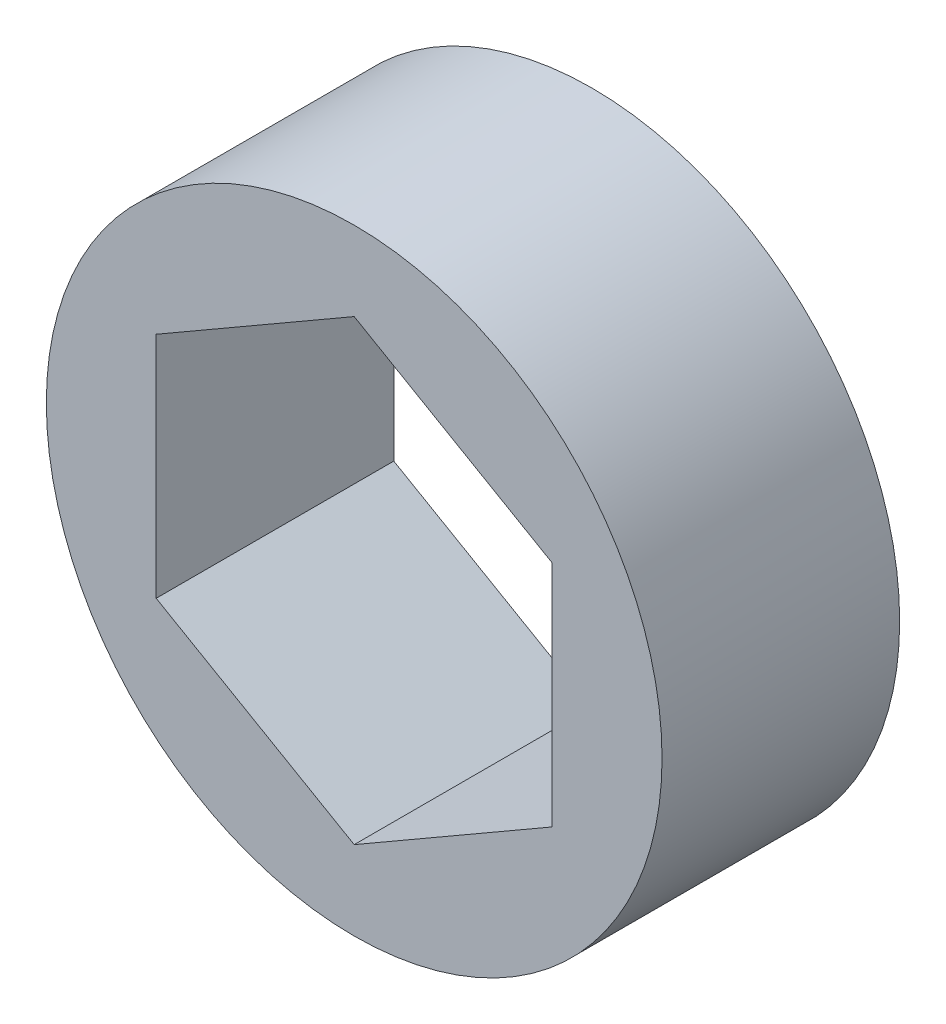
ISO-10303-21;
HEADER;
FILE_DESCRIPTION(('STEP AP214'),'2;1');
FILE_NAME('part.step','',(''),(''),'','','');
FILE_SCHEMA(('AUTOMOTIVE_DESIGN { 1 0 10303 214 1 1 1 1 }'));
ENDSEC;
DATA;
#1=APPLICATION_CONTEXT('core data for automotive mechanical design processes');
#2=APPLICATION_PROTOCOL_DEFINITION('international standard','automotive_design',2000,#1);
#3=PRODUCT_CONTEXT('',#1,'mechanical');
#4=PRODUCT('Part','Part','',(#3));
#5=PRODUCT_RELATED_PRODUCT_CATEGORY('part','',(#4));
#6=PRODUCT_DEFINITION_FORMATION('','',#4);
#7=PRODUCT_DEFINITION_CONTEXT('part definition',#1,'design');
#8=PRODUCT_DEFINITION('design','',#6,#7);
#9=PRODUCT_DEFINITION_SHAPE('','',#8);
#10=(LENGTH_UNIT() NAMED_UNIT(*) SI_UNIT(.MILLI.,.METRE.));
#11=(NAMED_UNIT(*) PLANE_ANGLE_UNIT() SI_UNIT($,.RADIAN.));
#12=(NAMED_UNIT(*) SI_UNIT($,.STERADIAN.) SOLID_ANGLE_UNIT());
#13=UNCERTAINTY_MEASURE_WITH_UNIT(LENGTH_MEASURE(1.E-05),#10,'distance_accuracy_value','');
#14=(GEOMETRIC_REPRESENTATION_CONTEXT(3) GLOBAL_UNCERTAINTY_ASSIGNED_CONTEXT((#13)) GLOBAL_UNIT_ASSIGNED_CONTEXT((#10,
#11,#12)) REPRESENTATION_CONTEXT('',''));
#15=CARTESIAN_POINT('',(0.,0.,0.));
#16=DIRECTION('',(0.,0.,1.));
#17=DIRECTION('',(1.,0.,0.));
#18=AXIS2_PLACEMENT_3D('',#15,#16,#17);
#19=CARTESIAN_POINT('',(-113.75212267549,2.16506350946108,3.));
#20=DIRECTION('',(-0.5,-0.866025403784438,0.));
#21=DIRECTION('',(0.866025403784438,-0.5,0.));
#22=AXIS2_PLACEMENT_3D('',#19,#20,#21);
#23=PLANE('',#22);
#24=DIRECTION('',(-0.866025403784438,0.5,0.));
#25=VECTOR('',#24,1.);
#26=CARTESIAN_POINT('',(-113.75212267549,2.16506350946108,0.));
#27=LINE('',#26,#25);
#28=CARTESIAN_POINT('',(-112.50212267549,1.44337567297406,0.));
#29=VERTEX_POINT('',#28);
#30=CARTESIAN_POINT('',(-115.00212267549,2.88675134594814,0.));
#31=VERTEX_POINT('',#30);
#32=EDGE_CURVE('E11',#29,#31,#27,.T.);
#33=ORIENTED_EDGE('',*,*,#32,.F.);
#34=DIRECTION('',(0.,0.,-1.));
#35=VECTOR('',#34,1.);
#36=CARTESIAN_POINT('',(-112.50212267549,1.44337567297406,3.));
#37=LINE('',#36,#35);
#38=CARTESIAN_POINT('',(-112.50212267549,1.44337567297406,3.));
#39=VERTEX_POINT('',#38);
#40=EDGE_CURVE('E23',#39,#29,#37,.T.);
#41=ORIENTED_EDGE('',*,*,#40,.F.);
#42=DIRECTION('',(-0.866025403784438,0.5,0.));
#43=VECTOR('',#42,1.);
#44=CARTESIAN_POINT('',(-113.75212267549,2.16506350946108,3.));
#45=LINE('',#44,#43);
#46=CARTESIAN_POINT('',(-115.00212267549,2.88675134594814,3.));
#47=VERTEX_POINT('',#46);
#48=EDGE_CURVE('E119',#39,#47,#45,.T.);
#49=ORIENTED_EDGE('',*,*,#48,.T.);
#50=DIRECTION('',(0.,0.,-1.));
#51=VECTOR('',#50,1.);
#52=CARTESIAN_POINT('',(-115.00212267549,2.88675134594814,3.));
#53=LINE('',#52,#51);
#54=EDGE_CURVE('E80',#47,#31,#53,.T.);
#55=ORIENTED_EDGE('',*,*,#54,.T.);
#56=EDGE_LOOP('',(#33,#41,#49,#55));
#57=FACE_BOUND('',#56,.T.);
#58=ADVANCED_FACE('F16',(#57),#23,.T.);
#59=CARTESIAN_POINT('',(-112.50212267549,0.,3.));
#60=DIRECTION('',(-1.,0.,0.));
#61=DIRECTION('',(0.,0.,1.));
#62=AXIS2_PLACEMENT_3D('',#59,#60,#61);
#63=PLANE('',#62);
#64=DIRECTION('',(0.,1.,0.));
#65=VECTOR('',#64,1.);
#66=CARTESIAN_POINT('',(-112.50212267549,0.,0.));
#67=LINE('',#66,#65);
#68=CARTESIAN_POINT('',(-112.50212267549,-1.44337567297405,0.));
#69=VERTEX_POINT('',#68);
#70=EDGE_CURVE('E115',#69,#29,#67,.T.);
#71=ORIENTED_EDGE('',*,*,#70,.F.);
#72=DIRECTION('',(0.,0.,-1.));
#73=VECTOR('',#72,1.);
#74=CARTESIAN_POINT('',(-112.50212267549,-1.44337567297405,3.));
#75=LINE('',#74,#73);
#76=CARTESIAN_POINT('',(-112.50212267549,-1.44337567297405,3.));
#77=VERTEX_POINT('',#76);
#78=EDGE_CURVE('E112',#77,#69,#75,.T.);
#79=ORIENTED_EDGE('',*,*,#78,.F.);
#80=DIRECTION('',(0.,1.,0.));
#81=VECTOR('',#80,1.);
#82=CARTESIAN_POINT('',(-112.50212267549,0.,3.));
#83=LINE('',#82,#81);
#84=EDGE_CURVE('E110',#77,#39,#83,.T.);
#85=ORIENTED_EDGE('',*,*,#84,.T.);
#86=ORIENTED_EDGE('',*,*,#40,.T.);
#87=EDGE_LOOP('',(#71,#79,#85,#86));
#88=FACE_BOUND('',#87,.T.);
#89=ADVANCED_FACE('F121',(#88),#63,.T.);
#90=CARTESIAN_POINT('',(-113.75212267549,-2.16506350946109,3.));
#91=DIRECTION('',(-0.5,0.866025403784439,0.));
#92=DIRECTION('',(-0.866025403784439,-0.5,0.));
#93=AXIS2_PLACEMENT_3D('',#90,#91,#92);
#94=PLANE('',#93);
#95=DIRECTION('',(0.866025403784439,0.5,0.));
#96=VECTOR('',#95,1.);
#97=CARTESIAN_POINT('',(-113.75212267549,-2.16506350946109,0.));
#98=LINE('',#97,#96);
#99=CARTESIAN_POINT('',(-115.00212267549,-2.88675134594815,0.));
#100=VERTEX_POINT('',#99);
#101=EDGE_CURVE('E107',#100,#69,#98,.T.);
#102=ORIENTED_EDGE('',*,*,#101,.F.);
#103=DIRECTION('',(0.,0.,-1.));
#104=VECTOR('',#103,1.);
#105=CARTESIAN_POINT('',(-115.00212267549,-2.88675134594815,3.));
#106=LINE('',#105,#104);
#107=CARTESIAN_POINT('',(-115.00212267549,-2.88675134594815,3.));
#108=VERTEX_POINT('',#107);
#109=EDGE_CURVE('E104',#108,#100,#106,.T.);
#110=ORIENTED_EDGE('',*,*,#109,.F.);
#111=DIRECTION('',(0.866025403784439,0.5,0.));
#112=VECTOR('',#111,1.);
#113=CARTESIAN_POINT('',(-113.75212267549,-2.16506350946109,3.));
#114=LINE('',#113,#112);
#115=EDGE_CURVE('E101',#108,#77,#114,.T.);
#116=ORIENTED_EDGE('',*,*,#115,.T.);
#117=ORIENTED_EDGE('',*,*,#78,.T.);
#118=EDGE_LOOP('',(#102,#110,#116,#117));
#119=FACE_BOUND('',#118,.T.);
#120=ADVANCED_FACE('F127',(#119),#94,.T.);
#121=CARTESIAN_POINT('',(-116.25212267549,-2.16506350946112,3.));
#122=DIRECTION('',(0.5,0.866025403784438,0.));
#123=DIRECTION('',(-0.866025403784438,0.5,0.));
#124=AXIS2_PLACEMENT_3D('',#121,#122,#123);
#125=PLANE('',#124);
#126=DIRECTION('',(0.866025403784438,-0.5,0.));
#127=VECTOR('',#126,1.);
#128=CARTESIAN_POINT('',(-116.25212267549,-2.16506350946112,0.));
#129=LINE('',#128,#127);
#130=CARTESIAN_POINT('',(-117.50212267549,-1.44337567297409,0.));
#131=VERTEX_POINT('',#130);
#132=EDGE_CURVE('E98',#131,#100,#129,.T.);
#133=ORIENTED_EDGE('',*,*,#132,.F.);
#134=DIRECTION('',(0.,0.,-1.));
#135=VECTOR('',#134,1.);
#136=CARTESIAN_POINT('',(-117.50212267549,-1.44337567297409,3.));
#137=LINE('',#136,#135);
#138=CARTESIAN_POINT('',(-117.50212267549,-1.44337567297409,3.));
#139=VERTEX_POINT('',#138);
#140=EDGE_CURVE('E96',#139,#131,#137,.T.);
#141=ORIENTED_EDGE('',*,*,#140,.F.);
#142=DIRECTION('',(0.866025403784438,-0.5,0.));
#143=VECTOR('',#142,1.);
#144=CARTESIAN_POINT('',(-116.25212267549,-2.16506350946112,3.));
#145=LINE('',#144,#143);
#146=EDGE_CURVE('E90',#139,#108,#145,.T.);
#147=ORIENTED_EDGE('',*,*,#146,.T.);
#148=ORIENTED_EDGE('',*,*,#109,.T.);
#149=EDGE_LOOP('',(#133,#141,#147,#148));
#150=FACE_BOUND('',#149,.T.);
#151=ADVANCED_FACE('F129',(#150),#125,.T.);
#152=CARTESIAN_POINT('',(-117.50212267549,0.,3.));
#153=DIRECTION('',(1.,0.,0.));
#154=DIRECTION('',(0.,0.,-1.));
#155=AXIS2_PLACEMENT_3D('',#152,#153,#154);
#156=PLANE('',#155);
#157=DIRECTION('',(0.,-1.,0.));
#158=VECTOR('',#157,1.);
#159=CARTESIAN_POINT('',(-117.50212267549,0.,0.));
#160=LINE('',#159,#158);
#161=CARTESIAN_POINT('',(-117.50212267549,1.44337567297407,0.));
#162=VERTEX_POINT('',#161);
#163=EDGE_CURVE('E71',#162,#131,#160,.T.);
#164=ORIENTED_EDGE('',*,*,#163,.F.);
#165=DIRECTION('',(0.,0.,-1.));
#166=VECTOR('',#165,1.);
#167=CARTESIAN_POINT('',(-117.50212267549,1.44337567297407,3.));
#168=LINE('',#167,#166);
#169=CARTESIAN_POINT('',(-117.50212267549,1.44337567297407,3.));
#170=VERTEX_POINT('',#169);
#171=EDGE_CURVE('E63',#170,#162,#168,.T.);
#172=ORIENTED_EDGE('',*,*,#171,.F.);
#173=DIRECTION('',(0.,-1.,0.));
#174=VECTOR('',#173,1.);
#175=CARTESIAN_POINT('',(-117.50212267549,0.,3.));
#176=LINE('',#175,#174);
#177=EDGE_CURVE('E68',#170,#139,#176,.T.);
#178=ORIENTED_EDGE('',*,*,#177,.T.);
#179=ORIENTED_EDGE('',*,*,#140,.T.);
#180=EDGE_LOOP('',(#164,#172,#178,#179));
#181=FACE_BOUND('',#180,.T.);
#182=ADVANCED_FACE('F65',(#181),#156,.T.);
#183=CARTESIAN_POINT('',(-116.25212267549,2.1650635094611,3.));
#184=DIRECTION('',(0.5,-0.866025403784439,0.));
#185=DIRECTION('',(0.86602540378444,0.5,0.));
#186=AXIS2_PLACEMENT_3D('',#183,#184,#185);
#187=PLANE('',#186);
#188=DIRECTION('',(-0.866025403784439,-0.499999999999999,0.));
#189=VECTOR('',#188,1.);
#190=CARTESIAN_POINT('',(-116.25212267549,2.1650635094611,0.));
#191=LINE('',#190,#189);
#192=EDGE_CURVE('E83',#31,#162,#191,.T.);
#193=ORIENTED_EDGE('',*,*,#192,.F.);
#194=ORIENTED_EDGE('',*,*,#54,.F.);
#195=DIRECTION('',(-0.866025403784439,-0.499999999999999,0.));
#196=VECTOR('',#195,1.);
#197=CARTESIAN_POINT('',(-116.25212267549,2.1650635094611,3.));
#198=LINE('',#197,#196);
#199=EDGE_CURVE('E78',#47,#170,#198,.T.);
#200=ORIENTED_EDGE('',*,*,#199,.T.);
#201=ORIENTED_EDGE('',*,*,#171,.T.);
#202=EDGE_LOOP('',(#193,#194,#200,#201));
#203=FACE_BOUND('',#202,.T.);
#204=ADVANCED_FACE('F79',(#203),#187,.T.);
#205=CARTESIAN_POINT('',(-115.00212267549,0.,3.));
#206=DIRECTION('',(0.,0.,-1.));
#207=DIRECTION('',(-1.,0.,0.));
#208=AXIS2_PLACEMENT_3D('',#205,#206,#207);
#209=CYLINDRICAL_SURFACE('',#208,3.88675134594811);
#210=CARTESIAN_POINT('',(-115.00212267549,0.,3.));
#211=DIRECTION('',(0.,0.,1.));
#212=DIRECTION('',(1.,0.,0.));
#213=AXIS2_PLACEMENT_3D('',#210,#211,#212);
#214=CIRCLE('',#213,3.88675134594811);
#215=CARTESIAN_POINT('',(-111.115371329542,0.,3.));
#216=VERTEX_POINT('',#215);
#217=EDGE_CURVE('E84',#216,#216,#214,.T.);
#218=ORIENTED_EDGE('',*,*,#217,.F.);
#219=EDGE_LOOP('',(#218));
#220=FACE_BOUND('',#219,.T.);
#221=CARTESIAN_POINT('',(-115.00212267549,0.,0.));
#222=DIRECTION('',(0.,0.,1.));
#223=DIRECTION('',(1.,0.,0.));
#224=AXIS2_PLACEMENT_3D('',#221,#222,#223);
#225=CIRCLE('',#224,3.88675134594811);
#226=CARTESIAN_POINT('',(-111.115371329542,0.,0.));
#227=VERTEX_POINT('',#226);
#228=EDGE_CURVE('E220',#227,#227,#225,.T.);
#229=ORIENTED_EDGE('',*,*,#228,.T.);
#230=EDGE_LOOP('',(#229));
#231=FACE_BOUND('',#230,.T.);
#232=ADVANCED_FACE('F146',(#220,#231),#209,.T.);
#233=CARTESIAN_POINT('',(-85.50212267549,0.,3.));
#234=DIRECTION('',(0.,0.,1.));
#235=DIRECTION('',(1.,0.,0.));
#236=AXIS2_PLACEMENT_3D('',#233,#234,#235);
#237=PLANE('',#236);
#238=ORIENTED_EDGE('',*,*,#48,.F.);
#239=ORIENTED_EDGE('',*,*,#84,.F.);
#240=ORIENTED_EDGE('',*,*,#115,.F.);
#241=ORIENTED_EDGE('',*,*,#146,.F.);
#242=ORIENTED_EDGE('',*,*,#177,.F.);
#243=ORIENTED_EDGE('',*,*,#199,.F.);
#244=EDGE_LOOP('',(#238,#239,#240,#241,#242,#243));
#245=FACE_BOUND('',#244,.T.);
#246=ORIENTED_EDGE('',*,*,#217,.T.);
#247=EDGE_LOOP('',(#246));
#248=FACE_BOUND('',#247,.T.);
#249=ADVANCED_FACE('F86',(#245,#248),#237,.T.);
#250=CARTESIAN_POINT('',(-85.50212267549,0.,0.));
#251=DIRECTION('',(0.,0.,1.));
#252=DIRECTION('',(1.,0.,0.));
#253=AXIS2_PLACEMENT_3D('',#250,#251,#252);
#254=PLANE('',#253);
#255=ORIENTED_EDGE('',*,*,#32,.T.);
#256=ORIENTED_EDGE('',*,*,#192,.T.);
#257=ORIENTED_EDGE('',*,*,#163,.T.);
#258=ORIENTED_EDGE('',*,*,#132,.T.);
#259=ORIENTED_EDGE('',*,*,#101,.T.);
#260=ORIENTED_EDGE('',*,*,#70,.T.);
#261=EDGE_LOOP('',(#255,#256,#257,#258,#259,#260));
#262=FACE_BOUND('',#261,.T.);
#263=ORIENTED_EDGE('',*,*,#228,.F.);
#264=EDGE_LOOP('',(#263));
#265=FACE_BOUND('',#264,.T.);
#266=ADVANCED_FACE('F124',(#262,#265),#254,.F.);
#267=CLOSED_SHELL('',(#58,#89,#120,#151,#182,#204,#232,#249,#266));
#268=MANIFOLD_SOLID_BREP('B1',#267);
#269=ADVANCED_BREP_SHAPE_REPRESENTATION('',(#18,#268),#14);
#270=SHAPE_DEFINITION_REPRESENTATION(#9,#269);
ENDSEC;
END-ISO-10303-21;
